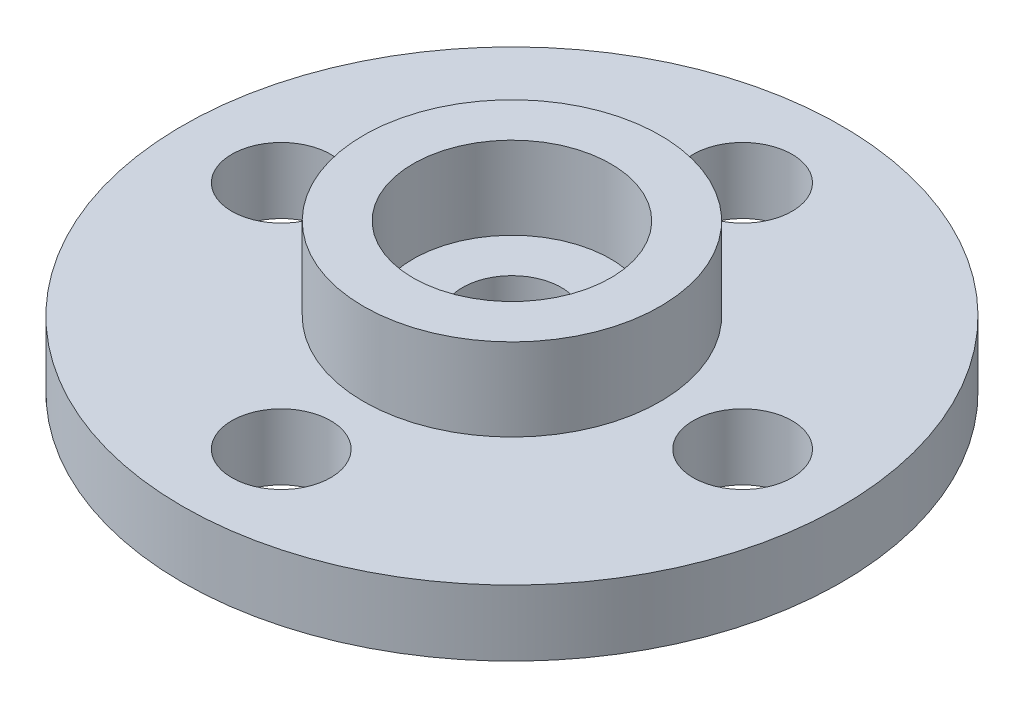
ISO-10303-21;
HEADER;
FILE_DESCRIPTION(('STEP AP214'),'2;1');
FILE_NAME('part.step','',(''),(''),'','','');
FILE_SCHEMA(('AUTOMOTIVE_DESIGN { 1 0 10303 214 1 1 1 1 }'));
ENDSEC;
DATA;
#1=APPLICATION_CONTEXT('core data for automotive mechanical design processes');
#2=APPLICATION_PROTOCOL_DEFINITION('international standard','automotive_design',2000,#1);
#3=PRODUCT_CONTEXT('',#1,'mechanical');
#4=PRODUCT('Part','Part','',(#3));
#5=PRODUCT_RELATED_PRODUCT_CATEGORY('part','',(#4));
#6=PRODUCT_DEFINITION_FORMATION('','',#4);
#7=PRODUCT_DEFINITION_CONTEXT('part definition',#1,'design');
#8=PRODUCT_DEFINITION('design','',#6,#7);
#9=PRODUCT_DEFINITION_SHAPE('','',#8);
#10=(LENGTH_UNIT() NAMED_UNIT(*) SI_UNIT(.MILLI.,.METRE.));
#11=(NAMED_UNIT(*) PLANE_ANGLE_UNIT() SI_UNIT($,.RADIAN.));
#12=(NAMED_UNIT(*) SI_UNIT($,.STERADIAN.) SOLID_ANGLE_UNIT());
#13=UNCERTAINTY_MEASURE_WITH_UNIT(LENGTH_MEASURE(1.E-05),#10,'distance_accuracy_value','');
#14=(GEOMETRIC_REPRESENTATION_CONTEXT(3) GLOBAL_UNCERTAINTY_ASSIGNED_CONTEXT((#13)) GLOBAL_UNIT_ASSIGNED_CONTEXT((#10,
#11,#12)) REPRESENTATION_CONTEXT('',''));
#15=CARTESIAN_POINT('',(0.,0.,0.));
#16=DIRECTION('',(0.,0.,1.));
#17=DIRECTION('',(1.,0.,0.));
#18=AXIS2_PLACEMENT_3D('',#15,#16,#17);
#19=CARTESIAN_POINT('',(0.,2.,0.));
#20=DIRECTION('',(0.,1.,0.));
#21=DIRECTION('',(0.,0.,1.));
#22=AXIS2_PLACEMENT_3D('',#19,#20,#21);
#23=PLANE('',#22);
#24=CARTESIAN_POINT('',(0.,2.,0.));
#25=DIRECTION('',(0.,1.,0.));
#26=DIRECTION('',(0.,0.,1.));
#27=AXIS2_PLACEMENT_3D('',#24,#25,#26);
#28=CIRCLE('',#27,1.5);
#29=CARTESIAN_POINT('',(0.,2.,1.5));
#30=VERTEX_POINT('',#29);
#31=EDGE_CURVE('E51',#30,#30,#28,.T.);
#32=ORIENTED_EDGE('',*,*,#31,.F.);
#33=EDGE_LOOP('',(#32));
#34=FACE_BOUND('',#33,.T.);
#35=CARTESIAN_POINT('',(0.,2.,0.));
#36=DIRECTION('',(0.,1.,0.));
#37=DIRECTION('',(0.,0.,1.));
#38=AXIS2_PLACEMENT_3D('',#35,#36,#37);
#39=CIRCLE('',#38,3.);
#40=CARTESIAN_POINT('',(0.,2.,3.));
#41=VERTEX_POINT('',#40);
#42=EDGE_CURVE('E10',#41,#41,#39,.F.);
#43=ORIENTED_EDGE('',*,*,#42,.F.);
#44=EDGE_LOOP('',(#43));
#45=FACE_BOUND('',#44,.T.);
#46=ADVANCED_FACE('F30',(#34,#45),#23,.T.);
#47=CARTESIAN_POINT('',(0.,2.,0.));
#48=DIRECTION('',(0.,1.,0.));
#49=DIRECTION('',(0.,0.,1.));
#50=AXIS2_PLACEMENT_3D('',#47,#48,#49);
#51=CIRCLE('',#50,4.5);
#52=CARTESIAN_POINT('',(0.,2.,4.5));
#53=VERTEX_POINT('',#52);
#54=EDGE_CURVE('E78',#53,#53,#51,.T.);
#55=ORIENTED_EDGE('',*,*,#54,.F.);
#56=EDGE_LOOP('',(#55));
#57=FACE_BOUND('',#56,.T.);
#58=CARTESIAN_POINT('',(0.,2.,-7.));
#59=DIRECTION('',(0.,1.,0.));
#60=DIRECTION('',(0.,0.,1.));
#61=AXIS2_PLACEMENT_3D('',#58,#59,#60);
#62=CIRCLE('',#61,1.5);
#63=CARTESIAN_POINT('',(0.,2.,-5.5));
#64=VERTEX_POINT('',#63);
#65=EDGE_CURVE('E63',#64,#64,#62,.T.);
#66=ORIENTED_EDGE('',*,*,#65,.F.);
#67=EDGE_LOOP('',(#66));
#68=FACE_BOUND('',#67,.T.);
#69=CARTESIAN_POINT('',(0.,2.,0.));
#70=DIRECTION('',(0.,1.,0.));
#71=DIRECTION('',(0.,0.,1.));
#72=AXIS2_PLACEMENT_3D('',#69,#70,#71);
#73=CIRCLE('',#72,10.);
#74=CARTESIAN_POINT('',(0.,2.,10.));
#75=VERTEX_POINT('',#74);
#76=EDGE_CURVE('E37',#75,#75,#73,.T.);
#77=ORIENTED_EDGE('',*,*,#76,.T.);
#78=EDGE_LOOP('',(#77));
#79=FACE_BOUND('',#78,.T.);
#80=CARTESIAN_POINT('',(0.,2.,7.));
#81=DIRECTION('',(0.,1.,0.));
#82=DIRECTION('',(0.,0.,1.));
#83=AXIS2_PLACEMENT_3D('',#80,#81,#82);
#84=CIRCLE('',#83,1.5);
#85=CARTESIAN_POINT('',(0.,2.,8.5));
#86=VERTEX_POINT('',#85);
#87=EDGE_CURVE('E46',#86,#86,#84,.T.);
#88=ORIENTED_EDGE('',*,*,#87,.F.);
#89=EDGE_LOOP('',(#88));
#90=FACE_BOUND('',#89,.T.);
#91=CARTESIAN_POINT('',(-7.,2.,0.));
#92=DIRECTION('',(0.,1.,0.));
#93=DIRECTION('',(0.,0.,1.));
#94=AXIS2_PLACEMENT_3D('',#91,#92,#93);
#95=CIRCLE('',#94,1.5);
#96=CARTESIAN_POINT('',(-7.,2.,1.5));
#97=VERTEX_POINT('',#96);
#98=EDGE_CURVE('E57',#97,#97,#95,.T.);
#99=ORIENTED_EDGE('',*,*,#98,.F.);
#100=EDGE_LOOP('',(#99));
#101=FACE_BOUND('',#100,.T.);
#102=CARTESIAN_POINT('',(7.,2.,0.));
#103=DIRECTION('',(0.,1.,0.));
#104=DIRECTION('',(0.,0.,1.));
#105=AXIS2_PLACEMENT_3D('',#102,#103,#104);
#106=CIRCLE('',#105,1.5);
#107=CARTESIAN_POINT('',(7.,2.,1.5));
#108=VERTEX_POINT('',#107);
#109=EDGE_CURVE('E69',#108,#108,#106,.T.);
#110=ORIENTED_EDGE('',*,*,#109,.F.);
#111=EDGE_LOOP('',(#110));
#112=FACE_BOUND('',#111,.T.);
#113=ADVANCED_FACE('F106',(#57,#68,#79,#90,#101,#112),#23,.T.);
#114=CARTESIAN_POINT('',(0.,0.,0.));
#115=DIRECTION('',(0.,1.,0.));
#116=DIRECTION('',(0.,0.,1.));
#117=AXIS2_PLACEMENT_3D('',#114,#115,#116);
#118=PLANE('',#117);
#119=CARTESIAN_POINT('',(0.,0.,0.));
#120=DIRECTION('',(0.,1.,0.));
#121=DIRECTION('',(0.,0.,1.));
#122=AXIS2_PLACEMENT_3D('',#119,#120,#121);
#123=CIRCLE('',#122,10.);
#124=CARTESIAN_POINT('',(0.,0.,10.));
#125=VERTEX_POINT('',#124);
#126=EDGE_CURVE('E41',#125,#125,#123,.T.);
#127=ORIENTED_EDGE('',*,*,#126,.F.);
#128=EDGE_LOOP('',(#127));
#129=FACE_BOUND('',#128,.T.);
#130=CARTESIAN_POINT('',(0.,0.,7.));
#131=DIRECTION('',(0.,1.,0.));
#132=DIRECTION('',(0.,0.,1.));
#133=AXIS2_PLACEMENT_3D('',#130,#131,#132);
#134=CIRCLE('',#133,1.5);
#135=CARTESIAN_POINT('',(0.,0.,8.5));
#136=VERTEX_POINT('',#135);
#137=EDGE_CURVE('E48',#136,#136,#134,.T.);
#138=ORIENTED_EDGE('',*,*,#137,.T.);
#139=EDGE_LOOP('',(#138));
#140=FACE_BOUND('',#139,.T.);
#141=CARTESIAN_POINT('',(0.,0.,0.));
#142=DIRECTION('',(0.,1.,0.));
#143=DIRECTION('',(0.,0.,1.));
#144=AXIS2_PLACEMENT_3D('',#141,#142,#143);
#145=CIRCLE('',#144,1.5);
#146=CARTESIAN_POINT('',(0.,0.,1.5));
#147=VERTEX_POINT('',#146);
#148=EDGE_CURVE('E54',#147,#147,#145,.T.);
#149=ORIENTED_EDGE('',*,*,#148,.T.);
#150=EDGE_LOOP('',(#149));
#151=FACE_BOUND('',#150,.T.);
#152=CARTESIAN_POINT('',(-7.,0.,0.));
#153=DIRECTION('',(0.,1.,0.));
#154=DIRECTION('',(0.,0.,1.));
#155=AXIS2_PLACEMENT_3D('',#152,#153,#154);
#156=CIRCLE('',#155,1.5);
#157=CARTESIAN_POINT('',(-7.,0.,1.5));
#158=VERTEX_POINT('',#157);
#159=EDGE_CURVE('E60',#158,#158,#156,.T.);
#160=ORIENTED_EDGE('',*,*,#159,.T.);
#161=EDGE_LOOP('',(#160));
#162=FACE_BOUND('',#161,.T.);
#163=CARTESIAN_POINT('',(0.,0.,-7.));
#164=DIRECTION('',(0.,1.,0.));
#165=DIRECTION('',(0.,0.,1.));
#166=AXIS2_PLACEMENT_3D('',#163,#164,#165);
#167=CIRCLE('',#166,1.5);
#168=CARTESIAN_POINT('',(0.,0.,-5.5));
#169=VERTEX_POINT('',#168);
#170=EDGE_CURVE('E66',#169,#169,#167,.T.);
#171=ORIENTED_EDGE('',*,*,#170,.T.);
#172=EDGE_LOOP('',(#171));
#173=FACE_BOUND('',#172,.T.);
#174=CARTESIAN_POINT('',(7.,0.,0.));
#175=DIRECTION('',(0.,1.,0.));
#176=DIRECTION('',(0.,0.,1.));
#177=AXIS2_PLACEMENT_3D('',#174,#175,#176);
#178=CIRCLE('',#177,1.5);
#179=CARTESIAN_POINT('',(7.,0.,1.5));
#180=VERTEX_POINT('',#179);
#181=EDGE_CURVE('E72',#180,#180,#178,.T.);
#182=ORIENTED_EDGE('',*,*,#181,.T.);
#183=EDGE_LOOP('',(#182));
#184=FACE_BOUND('',#183,.T.);
#185=ADVANCED_FACE('F112',(#129,#140,#151,#162,#173,#184),#118,.F.);
#186=CARTESIAN_POINT('',(0.,2.,0.));
#187=DIRECTION('',(0.,-1.,0.));
#188=DIRECTION('',(0.,0.,-1.));
#189=AXIS2_PLACEMENT_3D('',#186,#187,#188);
#190=CYLINDRICAL_SURFACE('',#189,10.);
#191=ORIENTED_EDGE('',*,*,#76,.F.);
#192=EDGE_LOOP('',(#191));
#193=FACE_BOUND('',#192,.T.);
#194=ORIENTED_EDGE('',*,*,#126,.T.);
#195=EDGE_LOOP('',(#194));
#196=FACE_BOUND('',#195,.T.);
#197=ADVANCED_FACE('F32',(#193,#196),#190,.T.);
#198=CARTESIAN_POINT('',(0.,2.,7.));
#199=DIRECTION('',(0.,-1.,0.));
#200=DIRECTION('',(0.,0.,-1.));
#201=AXIS2_PLACEMENT_3D('',#198,#199,#200);
#202=CYLINDRICAL_SURFACE('',#201,1.5);
#203=ORIENTED_EDGE('',*,*,#87,.T.);
#204=EDGE_LOOP('',(#203));
#205=FACE_BOUND('',#204,.T.);
#206=ORIENTED_EDGE('',*,*,#137,.F.);
#207=EDGE_LOOP('',(#206));
#208=FACE_BOUND('',#207,.T.);
#209=ADVANCED_FACE('F117',(#205,#208),#202,.F.);
#210=CARTESIAN_POINT('',(0.,2.,0.));
#211=DIRECTION('',(0.,-1.,0.));
#212=DIRECTION('',(0.,0.,-1.));
#213=AXIS2_PLACEMENT_3D('',#210,#211,#212);
#214=CYLINDRICAL_SURFACE('',#213,1.5);
#215=ORIENTED_EDGE('',*,*,#31,.T.);
#216=EDGE_LOOP('',(#215));
#217=FACE_BOUND('',#216,.T.);
#218=ORIENTED_EDGE('',*,*,#148,.F.);
#219=EDGE_LOOP('',(#218));
#220=FACE_BOUND('',#219,.T.);
#221=ADVANCED_FACE('F145',(#217,#220),#214,.F.);
#222=CARTESIAN_POINT('',(-7.,2.,0.));
#223=DIRECTION('',(0.,-1.,0.));
#224=DIRECTION('',(0.,0.,-1.));
#225=AXIS2_PLACEMENT_3D('',#222,#223,#224);
#226=CYLINDRICAL_SURFACE('',#225,1.5);
#227=ORIENTED_EDGE('',*,*,#98,.T.);
#228=EDGE_LOOP('',(#227));
#229=FACE_BOUND('',#228,.T.);
#230=ORIENTED_EDGE('',*,*,#159,.F.);
#231=EDGE_LOOP('',(#230));
#232=FACE_BOUND('',#231,.T.);
#233=ADVANCED_FACE('F139',(#229,#232),#226,.F.);
#234=CARTESIAN_POINT('',(0.,2.,-7.));
#235=DIRECTION('',(0.,-1.,0.));
#236=DIRECTION('',(0.,0.,-1.));
#237=AXIS2_PLACEMENT_3D('',#234,#235,#236);
#238=CYLINDRICAL_SURFACE('',#237,1.5);
#239=ORIENTED_EDGE('',*,*,#65,.T.);
#240=EDGE_LOOP('',(#239));
#241=FACE_BOUND('',#240,.T.);
#242=ORIENTED_EDGE('',*,*,#170,.F.);
#243=EDGE_LOOP('',(#242));
#244=FACE_BOUND('',#243,.T.);
#245=ADVANCED_FACE('F101',(#241,#244),#238,.F.);
#246=CARTESIAN_POINT('',(7.,2.,0.));
#247=DIRECTION('',(0.,-1.,0.));
#248=DIRECTION('',(0.,0.,-1.));
#249=AXIS2_PLACEMENT_3D('',#246,#247,#248);
#250=CYLINDRICAL_SURFACE('',#249,1.5);
#251=ORIENTED_EDGE('',*,*,#109,.T.);
#252=EDGE_LOOP('',(#251));
#253=FACE_BOUND('',#252,.T.);
#254=ORIENTED_EDGE('',*,*,#181,.F.);
#255=EDGE_LOOP('',(#254));
#256=FACE_BOUND('',#255,.T.);
#257=ADVANCED_FACE('F92',(#253,#256),#250,.F.);
#258=CARTESIAN_POINT('',(0.,4.5,0.));
#259=DIRECTION('',(0.,1.,0.));
#260=DIRECTION('',(0.,0.,1.));
#261=AXIS2_PLACEMENT_3D('',#258,#259,#260);
#262=PLANE('',#261);
#263=CARTESIAN_POINT('',(0.,4.5,0.));
#264=DIRECTION('',(0.,1.,0.));
#265=DIRECTION('',(0.,0.,1.));
#266=AXIS2_PLACEMENT_3D('',#263,#264,#265);
#267=CIRCLE('',#266,4.5);
#268=CARTESIAN_POINT('',(0.,4.5,4.5));
#269=VERTEX_POINT('',#268);
#270=EDGE_CURVE('E75',#269,#269,#267,.T.);
#271=ORIENTED_EDGE('',*,*,#270,.T.);
#272=EDGE_LOOP('',(#271));
#273=FACE_BOUND('',#272,.T.);
#274=CARTESIAN_POINT('',(0.,4.5,0.));
#275=DIRECTION('',(0.,1.,0.));
#276=DIRECTION('',(0.,0.,1.));
#277=AXIS2_PLACEMENT_3D('',#274,#275,#276);
#278=CIRCLE('',#277,3.);
#279=CARTESIAN_POINT('',(0.,4.5,3.));
#280=VERTEX_POINT('',#279);
#281=EDGE_CURVE('E81',#280,#280,#278,.T.);
#282=ORIENTED_EDGE('',*,*,#281,.F.);
#283=EDGE_LOOP('',(#282));
#284=FACE_BOUND('',#283,.T.);
#285=ADVANCED_FACE('F89',(#273,#284),#262,.T.);
#286=CARTESIAN_POINT('',(0.,4.5,0.));
#287=DIRECTION('',(0.,-1.,0.));
#288=DIRECTION('',(0.,0.,-1.));
#289=AXIS2_PLACEMENT_3D('',#286,#287,#288);
#290=CYLINDRICAL_SURFACE('',#289,4.5);
#291=ORIENTED_EDGE('',*,*,#270,.F.);
#292=EDGE_LOOP('',(#291));
#293=FACE_BOUND('',#292,.T.);
#294=ORIENTED_EDGE('',*,*,#54,.T.);
#295=EDGE_LOOP('',(#294));
#296=FACE_BOUND('',#295,.T.);
#297=ADVANCED_FACE('F91',(#293,#296),#290,.T.);
#298=CARTESIAN_POINT('',(0.,4.5,0.));
#299=DIRECTION('',(0.,-1.,0.));
#300=DIRECTION('',(0.,0.,-1.));
#301=AXIS2_PLACEMENT_3D('',#298,#299,#300);
#302=CYLINDRICAL_SURFACE('',#301,3.);
#303=ORIENTED_EDGE('',*,*,#281,.T.);
#304=EDGE_LOOP('',(#303));
#305=FACE_BOUND('',#304,.T.);
#306=ORIENTED_EDGE('',*,*,#42,.T.);
#307=EDGE_LOOP('',(#306));
#308=FACE_BOUND('',#307,.T.);
#309=ADVANCED_FACE('F87',(#305,#308),#302,.F.);
#310=CLOSED_SHELL('',(#46,#113,#185,#197,#209,#221,#233,#245,#257,#285,#297,#309));
#311=MANIFOLD_SOLID_BREP('B2',#310);
#312=ADVANCED_BREP_SHAPE_REPRESENTATION('',(#18,#311),#14);
#313=SHAPE_DEFINITION_REPRESENTATION(#9,#312);
ENDSEC;
END-ISO-10303-21;
